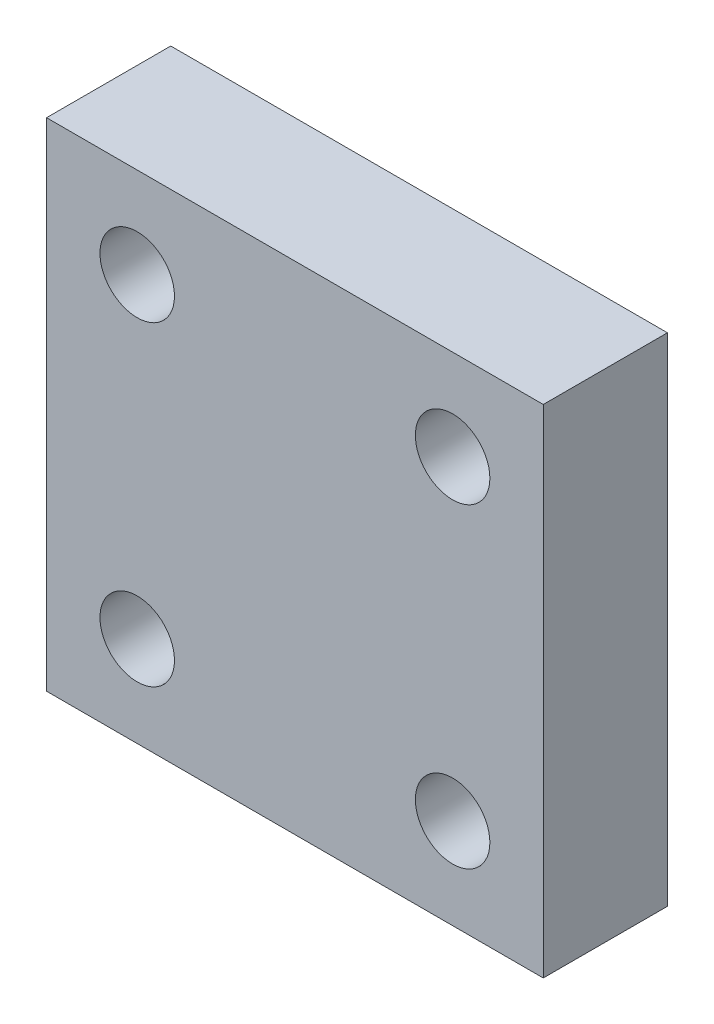
ISO-10303-21;
HEADER;
FILE_DESCRIPTION(('STEP AP214'),'2;1');
FILE_NAME('part.step','',(''),(''),'','','');
FILE_SCHEMA(('AUTOMOTIVE_DESIGN { 1 0 10303 214 1 1 1 1 }'));
ENDSEC;
DATA;
#1=APPLICATION_CONTEXT('core data for automotive mechanical design processes');
#2=APPLICATION_PROTOCOL_DEFINITION('international standard','automotive_design',2000,#1);
#3=PRODUCT_CONTEXT('',#1,'mechanical');
#4=PRODUCT('Part','Part','',(#3));
#5=PRODUCT_RELATED_PRODUCT_CATEGORY('part','',(#4));
#6=PRODUCT_DEFINITION_FORMATION('','',#4);
#7=PRODUCT_DEFINITION_CONTEXT('part definition',#1,'design');
#8=PRODUCT_DEFINITION('design','',#6,#7);
#9=PRODUCT_DEFINITION_SHAPE('','',#8);
#10=(LENGTH_UNIT() NAMED_UNIT(*) SI_UNIT(.MILLI.,.METRE.));
#11=(NAMED_UNIT(*) PLANE_ANGLE_UNIT() SI_UNIT($,.RADIAN.));
#12=(NAMED_UNIT(*) SI_UNIT($,.STERADIAN.) SOLID_ANGLE_UNIT());
#13=UNCERTAINTY_MEASURE_WITH_UNIT(LENGTH_MEASURE(1.E-05),#10,'distance_accuracy_value','');
#14=(GEOMETRIC_REPRESENTATION_CONTEXT(3) GLOBAL_UNCERTAINTY_ASSIGNED_CONTEXT((#13)) GLOBAL_UNIT_ASSIGNED_CONTEXT((#10,
#11,#12)) REPRESENTATION_CONTEXT('',''));
#15=CARTESIAN_POINT('',(0.,0.,0.));
#16=DIRECTION('',(0.,0.,1.));
#17=DIRECTION('',(1.,0.,0.));
#18=AXIS2_PLACEMENT_3D('',#15,#16,#17);
#19=CARTESIAN_POINT('',(0.,0.,0.));
#20=DIRECTION('',(0.,0.,-1.));
#21=DIRECTION('',(-1.,0.,0.));
#22=AXIS2_PLACEMENT_3D('',#19,#20,#21);
#23=PLANE('',#22);
#24=CARTESIAN_POINT('',(-4.12000000000012,-4.12500000000002,0.));
#25=DIRECTION('',(0.,0.,1.));
#26=DIRECTION('',(1.,0.,0.));
#27=AXIS2_PLACEMENT_3D('',#24,#25,#26);
#28=CIRCLE('',#27,1.32);
#29=CARTESIAN_POINT('',(-2.80000000000012,-4.12500000000002,0.));
#30=VERTEX_POINT('',#29);
#31=EDGE_CURVE('E124',#30,#30,#28,.T.);
#32=ORIENTED_EDGE('',*,*,#31,.T.);
#33=EDGE_LOOP('',(#32));
#34=FACE_BOUND('',#33,.T.);
#35=CARTESIAN_POINT('',(-35.87,-35.875,0.));
#36=DIRECTION('',(0.,0.,1.));
#37=DIRECTION('',(1.,0.,0.));
#38=AXIS2_PLACEMENT_3D('',#35,#36,#37);
#39=CIRCLE('',#38,1.32);
#40=CARTESIAN_POINT('',(-34.55,-35.875,0.));
#41=VERTEX_POINT('',#40);
#42=EDGE_CURVE('E112',#41,#41,#39,.T.);
#43=ORIENTED_EDGE('',*,*,#42,.T.);
#44=EDGE_LOOP('',(#43));
#45=FACE_BOUND('',#44,.T.);
#46=DIRECTION('',(0.,1.,0.));
#47=VECTOR('',#46,1.);
#48=CARTESIAN_POINT('',(0.,0.,0.));
#49=LINE('',#48,#47);
#50=CARTESIAN_POINT('',(0.,-40.,0.));
#51=VERTEX_POINT('',#50);
#52=CARTESIAN_POINT('',(0.,0.,0.));
#53=VERTEX_POINT('',#52);
#54=EDGE_CURVE('E98',#51,#53,#49,.T.);
#55=ORIENTED_EDGE('',*,*,#54,.F.);
#56=DIRECTION('',(1.,0.,0.));
#57=VECTOR('',#56,1.);
#58=CARTESIAN_POINT('',(0.,-40.,0.));
#59=LINE('',#58,#57);
#60=CARTESIAN_POINT('',(-40.,-40.,0.));
#61=VERTEX_POINT('',#60);
#62=EDGE_CURVE('E74',#61,#51,#59,.T.);
#63=ORIENTED_EDGE('',*,*,#62,.F.);
#64=DIRECTION('',(0.,-1.,0.));
#65=VECTOR('',#64,1.);
#66=CARTESIAN_POINT('',(-40.,0.,0.));
#67=LINE('',#66,#65);
#68=CARTESIAN_POINT('',(-40.,0.,0.));
#69=VERTEX_POINT('',#68);
#70=EDGE_CURVE('E68',#69,#61,#67,.T.);
#71=ORIENTED_EDGE('',*,*,#70,.F.);
#72=DIRECTION('',(-1.,0.,0.));
#73=VECTOR('',#72,1.);
#74=CARTESIAN_POINT('',(0.,0.,0.));
#75=LINE('',#74,#73);
#76=EDGE_CURVE('E90',#53,#69,#75,.T.);
#77=ORIENTED_EDGE('',*,*,#76,.F.);
#78=EDGE_LOOP('',(#55,#63,#71,#77));
#79=FACE_BOUND('',#78,.T.);
#80=CARTESIAN_POINT('',(-4.12000000000001,-35.875,0.));
#81=DIRECTION('',(0.,0.,1.));
#82=DIRECTION('',(1.,0.,0.));
#83=AXIS2_PLACEMENT_3D('',#80,#81,#82);
#84=CIRCLE('',#83,1.32);
#85=CARTESIAN_POINT('',(-2.8,-35.875,0.));
#86=VERTEX_POINT('',#85);
#87=EDGE_CURVE('E118',#86,#86,#84,.T.);
#88=ORIENTED_EDGE('',*,*,#87,.T.);
#89=EDGE_LOOP('',(#88));
#90=FACE_BOUND('',#89,.T.);
#91=CARTESIAN_POINT('',(-35.8700000000001,-4.12500000000002,0.));
#92=DIRECTION('',(0.,0.,1.));
#93=DIRECTION('',(1.,0.,0.));
#94=AXIS2_PLACEMENT_3D('',#91,#92,#93);
#95=CIRCLE('',#94,1.32);
#96=CARTESIAN_POINT('',(-34.5500000000001,-4.12500000000002,0.));
#97=VERTEX_POINT('',#96);
#98=EDGE_CURVE('E130',#97,#97,#95,.T.);
#99=ORIENTED_EDGE('',*,*,#98,.T.);
#100=EDGE_LOOP('',(#99));
#101=FACE_BOUND('',#100,.T.);
#102=ADVANCED_FACE('F34',(#34,#45,#79,#90,#101),#23,.T.);
#103=CARTESIAN_POINT('',(0.,0.,10.));
#104=DIRECTION('',(-1.,0.,0.));
#105=DIRECTION('',(0.,-1.,0.));
#106=AXIS2_PLACEMENT_3D('',#103,#104,#105);
#107=PLANE('',#106);
#108=ORIENTED_EDGE('',*,*,#54,.T.);
#109=DIRECTION('',(0.,0.,-1.));
#110=VECTOR('',#109,1.);
#111=CARTESIAN_POINT('',(0.,0.,10.));
#112=LINE('',#111,#110);
#113=CARTESIAN_POINT('',(0.,0.,10.));
#114=VERTEX_POINT('',#113);
#115=EDGE_CURVE('E11',#114,#53,#112,.T.);
#116=ORIENTED_EDGE('',*,*,#115,.F.);
#117=DIRECTION('',(0.,1.,0.));
#118=VECTOR('',#117,1.);
#119=CARTESIAN_POINT('',(0.,0.,10.));
#120=LINE('',#119,#118);
#121=CARTESIAN_POINT('',(0.,-40.,10.));
#122=VERTEX_POINT('',#121);
#123=EDGE_CURVE('E86',#122,#114,#120,.T.);
#124=ORIENTED_EDGE('',*,*,#123,.F.);
#125=DIRECTION('',(0.,0.,-1.));
#126=VECTOR('',#125,1.);
#127=CARTESIAN_POINT('',(0.,-40.,10.));
#128=LINE('',#127,#126);
#129=EDGE_CURVE('E94',#122,#51,#128,.T.);
#130=ORIENTED_EDGE('',*,*,#129,.T.);
#131=EDGE_LOOP('',(#108,#116,#124,#130));
#132=FACE_BOUND('',#131,.T.);
#133=ADVANCED_FACE('F36',(#132),#107,.F.);
#134=CARTESIAN_POINT('',(0.,0.,10.));
#135=DIRECTION('',(0.,-1.,0.));
#136=DIRECTION('',(1.,0.,0.));
#137=AXIS2_PLACEMENT_3D('',#134,#135,#136);
#138=PLANE('',#137);
#139=ORIENTED_EDGE('',*,*,#76,.T.);
#140=DIRECTION('',(0.,0.,-1.));
#141=VECTOR('',#140,1.);
#142=CARTESIAN_POINT('',(-40.,0.,10.));
#143=LINE('',#142,#141);
#144=CARTESIAN_POINT('',(-40.,0.,10.));
#145=VERTEX_POINT('',#144);
#146=EDGE_CURVE('E43',#145,#69,#143,.T.);
#147=ORIENTED_EDGE('',*,*,#146,.F.);
#148=DIRECTION('',(-1.,0.,0.));
#149=VECTOR('',#148,1.);
#150=CARTESIAN_POINT('',(0.,0.,10.));
#151=LINE('',#150,#149);
#152=EDGE_CURVE('E81',#114,#145,#151,.T.);
#153=ORIENTED_EDGE('',*,*,#152,.F.);
#154=ORIENTED_EDGE('',*,*,#115,.T.);
#155=EDGE_LOOP('',(#139,#147,#153,#154));
#156=FACE_BOUND('',#155,.T.);
#157=ADVANCED_FACE('F89',(#156),#138,.F.);
#158=CARTESIAN_POINT('',(-40.,0.,10.));
#159=DIRECTION('',(1.,0.,0.));
#160=DIRECTION('',(0.,1.,0.));
#161=AXIS2_PLACEMENT_3D('',#158,#159,#160);
#162=PLANE('',#161);
#163=ORIENTED_EDGE('',*,*,#70,.T.);
#164=DIRECTION('',(0.,0.,-1.));
#165=VECTOR('',#164,1.);
#166=CARTESIAN_POINT('',(-40.,-40.,10.));
#167=LINE('',#166,#165);
#168=CARTESIAN_POINT('',(-40.,-40.,10.));
#169=VERTEX_POINT('',#168);
#170=EDGE_CURVE('E91',#169,#61,#167,.T.);
#171=ORIENTED_EDGE('',*,*,#170,.F.);
#172=DIRECTION('',(0.,-1.,0.));
#173=VECTOR('',#172,1.);
#174=CARTESIAN_POINT('',(-40.,0.,10.));
#175=LINE('',#174,#173);
#176=EDGE_CURVE('E84',#145,#169,#175,.T.);
#177=ORIENTED_EDGE('',*,*,#176,.F.);
#178=ORIENTED_EDGE('',*,*,#146,.T.);
#179=EDGE_LOOP('',(#163,#171,#177,#178));
#180=FACE_BOUND('',#179,.T.);
#181=ADVANCED_FACE('F92',(#180),#162,.F.);
#182=CARTESIAN_POINT('',(0.,-40.,10.));
#183=DIRECTION('',(0.,1.,0.));
#184=DIRECTION('',(0.,0.,1.));
#185=AXIS2_PLACEMENT_3D('',#182,#183,#184);
#186=PLANE('',#185);
#187=ORIENTED_EDGE('',*,*,#62,.T.);
#188=ORIENTED_EDGE('',*,*,#129,.F.);
#189=DIRECTION('',(1.,0.,0.));
#190=VECTOR('',#189,1.);
#191=CARTESIAN_POINT('',(0.,-40.,10.));
#192=LINE('',#191,#190);
#193=EDGE_CURVE('E51',#169,#122,#192,.T.);
#194=ORIENTED_EDGE('',*,*,#193,.F.);
#195=ORIENTED_EDGE('',*,*,#170,.T.);
#196=EDGE_LOOP('',(#187,#188,#194,#195));
#197=FACE_BOUND('',#196,.T.);
#198=ADVANCED_FACE('F106',(#197),#186,.F.);
#199=CARTESIAN_POINT('',(0.,0.,10.));
#200=DIRECTION('',(0.,0.,-1.));
#201=DIRECTION('',(-1.,0.,0.));
#202=AXIS2_PLACEMENT_3D('',#199,#200,#201);
#203=PLANE('',#202);
#204=CARTESIAN_POINT('',(-32.6999999999997,-32.7,10.));
#205=DIRECTION('',(0.,0.,1.));
#206=DIRECTION('',(1.,0.,0.));
#207=AXIS2_PLACEMENT_3D('',#204,#205,#206);
#208=CIRCLE('',#207,3.);
#209=CARTESIAN_POINT('',(-29.6999999999997,-32.7,10.));
#210=VERTEX_POINT('',#209);
#211=EDGE_CURVE('E154',#210,#210,#208,.T.);
#212=ORIENTED_EDGE('',*,*,#211,.F.);
#213=EDGE_LOOP('',(#212));
#214=FACE_BOUND('',#213,.T.);
#215=CARTESIAN_POINT('',(-7.29999999999974,-32.6999999999996,10.));
#216=DIRECTION('',(0.,0.,1.));
#217=DIRECTION('',(1.,0.,0.));
#218=AXIS2_PLACEMENT_3D('',#215,#216,#217);
#219=CIRCLE('',#218,3.);
#220=CARTESIAN_POINT('',(-4.29999999999974,-32.6999999999996,10.));
#221=VERTEX_POINT('',#220);
#222=EDGE_CURVE('E148',#221,#221,#219,.T.);
#223=ORIENTED_EDGE('',*,*,#222,.F.);
#224=EDGE_LOOP('',(#223));
#225=FACE_BOUND('',#224,.T.);
#226=CARTESIAN_POINT('',(-7.30000000000001,-7.29999999999965,10.));
#227=DIRECTION('',(0.,0.,1.));
#228=DIRECTION('',(1.,0.,0.));
#229=AXIS2_PLACEMENT_3D('',#226,#227,#228);
#230=CIRCLE('',#229,3.);
#231=CARTESIAN_POINT('',(-4.30000000000001,-7.29999999999965,10.));
#232=VERTEX_POINT('',#231);
#233=EDGE_CURVE('E142',#232,#232,#230,.T.);
#234=ORIENTED_EDGE('',*,*,#233,.F.);
#235=EDGE_LOOP('',(#234));
#236=FACE_BOUND('',#235,.T.);
#237=CARTESIAN_POINT('',(-32.7,-7.3,10.));
#238=DIRECTION('',(0.,0.,1.));
#239=DIRECTION('',(1.,0.,0.));
#240=AXIS2_PLACEMENT_3D('',#237,#238,#239);
#241=CIRCLE('',#240,3.);
#242=CARTESIAN_POINT('',(-29.7,-7.3,10.));
#243=VERTEX_POINT('',#242);
#244=EDGE_CURVE('E136',#243,#243,#241,.T.);
#245=ORIENTED_EDGE('',*,*,#244,.F.);
#246=EDGE_LOOP('',(#245));
#247=FACE_BOUND('',#246,.T.);
#248=ORIENTED_EDGE('',*,*,#123,.T.);
#249=ORIENTED_EDGE('',*,*,#152,.T.);
#250=ORIENTED_EDGE('',*,*,#176,.T.);
#251=ORIENTED_EDGE('',*,*,#193,.T.);
#252=EDGE_LOOP('',(#248,#249,#250,#251));
#253=FACE_BOUND('',#252,.T.);
#254=ADVANCED_FACE('F82',(#214,#225,#236,#247,#253),#203,.F.);
#255=CARTESIAN_POINT('',(-35.87,-35.875,5.));
#256=DIRECTION('',(0.,0.,-1.));
#257=DIRECTION('',(-1.,0.,0.));
#258=AXIS2_PLACEMENT_3D('',#255,#256,#257);
#259=CYLINDRICAL_SURFACE('',#258,1.32);
#260=CARTESIAN_POINT('',(-35.87,-35.875,5.));
#261=DIRECTION('',(0.,0.,1.));
#262=DIRECTION('',(1.,0.,0.));
#263=AXIS2_PLACEMENT_3D('',#260,#261,#262);
#264=CIRCLE('',#263,1.32);
#265=CARTESIAN_POINT('',(-34.55,-35.875,5.));
#266=VERTEX_POINT('',#265);
#267=EDGE_CURVE('E101',#266,#266,#264,.T.);
#268=ORIENTED_EDGE('',*,*,#267,.T.);
#269=EDGE_LOOP('',(#268));
#270=FACE_BOUND('',#269,.T.);
#271=ORIENTED_EDGE('',*,*,#42,.F.);
#272=EDGE_LOOP('',(#271));
#273=FACE_BOUND('',#272,.T.);
#274=ADVANCED_FACE('F171',(#270,#273),#259,.F.);
#275=CARTESIAN_POINT('',(-35.87,-35.875,5.));
#276=DIRECTION('',(0.,0.,1.));
#277=DIRECTION('',(1.,0.,0.));
#278=AXIS2_PLACEMENT_3D('',#275,#276,#277);
#279=PLANE('',#278);
#280=ORIENTED_EDGE('',*,*,#267,.F.);
#281=EDGE_LOOP('',(#280));
#282=FACE_BOUND('',#281,.T.);
#283=ADVANCED_FACE('F231',(#282),#279,.F.);
#284=CARTESIAN_POINT('',(-4.12000000000001,-35.875,5.));
#285=DIRECTION('',(0.,0.,-1.));
#286=DIRECTION('',(-1.,0.,0.));
#287=AXIS2_PLACEMENT_3D('',#284,#285,#286);
#288=CYLINDRICAL_SURFACE('',#287,1.32);
#289=CARTESIAN_POINT('',(-4.12000000000001,-35.875,5.));
#290=DIRECTION('',(0.,0.,1.));
#291=DIRECTION('',(1.,0.,0.));
#292=AXIS2_PLACEMENT_3D('',#289,#290,#291);
#293=CIRCLE('',#292,1.32);
#294=CARTESIAN_POINT('',(-2.8,-35.875,5.));
#295=VERTEX_POINT('',#294);
#296=EDGE_CURVE('E115',#295,#295,#293,.T.);
#297=ORIENTED_EDGE('',*,*,#296,.T.);
#298=EDGE_LOOP('',(#297));
#299=FACE_BOUND('',#298,.T.);
#300=ORIENTED_EDGE('',*,*,#87,.F.);
#301=EDGE_LOOP('',(#300));
#302=FACE_BOUND('',#301,.T.);
#303=ADVANCED_FACE('F238',(#299,#302),#288,.F.);
#304=CARTESIAN_POINT('',(-4.12000000000001,-35.875,5.));
#305=DIRECTION('',(0.,0.,1.));
#306=DIRECTION('',(1.,0.,0.));
#307=AXIS2_PLACEMENT_3D('',#304,#305,#306);
#308=PLANE('',#307);
#309=ORIENTED_EDGE('',*,*,#296,.F.);
#310=EDGE_LOOP('',(#309));
#311=FACE_BOUND('',#310,.T.);
#312=ADVANCED_FACE('F246',(#311),#308,.F.);
#313=CARTESIAN_POINT('',(-4.12000000000012,-4.12500000000002,5.));
#314=DIRECTION('',(0.,0.,-1.));
#315=DIRECTION('',(-1.,0.,0.));
#316=AXIS2_PLACEMENT_3D('',#313,#314,#315);
#317=CYLINDRICAL_SURFACE('',#316,1.32);
#318=CARTESIAN_POINT('',(-4.12000000000012,-4.12500000000002,5.));
#319=DIRECTION('',(0.,0.,1.));
#320=DIRECTION('',(1.,0.,0.));
#321=AXIS2_PLACEMENT_3D('',#318,#319,#320);
#322=CIRCLE('',#321,1.32);
#323=CARTESIAN_POINT('',(-2.80000000000012,-4.12500000000002,5.));
#324=VERTEX_POINT('',#323);
#325=EDGE_CURVE('E121',#324,#324,#322,.T.);
#326=ORIENTED_EDGE('',*,*,#325,.T.);
#327=EDGE_LOOP('',(#326));
#328=FACE_BOUND('',#327,.T.);
#329=ORIENTED_EDGE('',*,*,#31,.F.);
#330=EDGE_LOOP('',(#329));
#331=FACE_BOUND('',#330,.T.);
#332=ADVANCED_FACE('F254',(#328,#331),#317,.F.);
#333=CARTESIAN_POINT('',(-4.12000000000012,-4.12500000000002,5.));
#334=DIRECTION('',(0.,0.,1.));
#335=DIRECTION('',(1.,0.,0.));
#336=AXIS2_PLACEMENT_3D('',#333,#334,#335);
#337=PLANE('',#336);
#338=ORIENTED_EDGE('',*,*,#325,.F.);
#339=EDGE_LOOP('',(#338));
#340=FACE_BOUND('',#339,.T.);
#341=ADVANCED_FACE('F262',(#340),#337,.F.);
#342=CARTESIAN_POINT('',(-35.8700000000001,-4.12500000000002,5.));
#343=DIRECTION('',(0.,0.,-1.));
#344=DIRECTION('',(-1.,0.,0.));
#345=AXIS2_PLACEMENT_3D('',#342,#343,#344);
#346=CYLINDRICAL_SURFACE('',#345,1.32);
#347=CARTESIAN_POINT('',(-35.8700000000001,-4.12500000000002,5.));
#348=DIRECTION('',(0.,0.,1.));
#349=DIRECTION('',(1.,0.,0.));
#350=AXIS2_PLACEMENT_3D('',#347,#348,#349);
#351=CIRCLE('',#350,1.32);
#352=CARTESIAN_POINT('',(-34.5500000000001,-4.12500000000002,5.));
#353=VERTEX_POINT('',#352);
#354=EDGE_CURVE('E127',#353,#353,#351,.T.);
#355=ORIENTED_EDGE('',*,*,#354,.T.);
#356=EDGE_LOOP('',(#355));
#357=FACE_BOUND('',#356,.T.);
#358=ORIENTED_EDGE('',*,*,#98,.F.);
#359=EDGE_LOOP('',(#358));
#360=FACE_BOUND('',#359,.T.);
#361=ADVANCED_FACE('F192',(#357,#360),#346,.F.);
#362=CARTESIAN_POINT('',(-35.8700000000001,-4.12500000000002,5.));
#363=DIRECTION('',(0.,0.,1.));
#364=DIRECTION('',(1.,0.,0.));
#365=AXIS2_PLACEMENT_3D('',#362,#363,#364);
#366=PLANE('',#365);
#367=ORIENTED_EDGE('',*,*,#354,.F.);
#368=EDGE_LOOP('',(#367));
#369=FACE_BOUND('',#368,.T.);
#370=ADVANCED_FACE('F182',(#369),#366,.F.);
#371=CARTESIAN_POINT('',(-32.7,-7.3,5.));
#372=DIRECTION('',(0.,0.,1.));
#373=DIRECTION('',(1.,0.,0.));
#374=AXIS2_PLACEMENT_3D('',#371,#372,#373);
#375=CYLINDRICAL_SURFACE('',#374,3.);
#376=CARTESIAN_POINT('',(-32.7,-7.3,5.));
#377=DIRECTION('',(0.,0.,1.));
#378=DIRECTION('',(1.,0.,0.));
#379=AXIS2_PLACEMENT_3D('',#376,#377,#378);
#380=CIRCLE('',#379,3.);
#381=CARTESIAN_POINT('',(-29.7,-7.3,5.));
#382=VERTEX_POINT('',#381);
#383=EDGE_CURVE('E133',#382,#382,#380,.T.);
#384=ORIENTED_EDGE('',*,*,#383,.F.);
#385=EDGE_LOOP('',(#384));
#386=FACE_BOUND('',#385,.T.);
#387=ORIENTED_EDGE('',*,*,#244,.T.);
#388=EDGE_LOOP('',(#387));
#389=FACE_BOUND('',#388,.T.);
#390=ADVANCED_FACE('F179',(#386,#389),#375,.F.);
#391=CARTESIAN_POINT('',(-32.7,-7.3,5.));
#392=DIRECTION('',(0.,0.,1.));
#393=DIRECTION('',(1.,0.,0.));
#394=AXIS2_PLACEMENT_3D('',#391,#392,#393);
#395=PLANE('',#394);
#396=ORIENTED_EDGE('',*,*,#383,.T.);
#397=EDGE_LOOP('',(#396));
#398=FACE_BOUND('',#397,.T.);
#399=ADVANCED_FACE('F181',(#398),#395,.T.);
#400=CARTESIAN_POINT('',(-7.30000000000001,-7.29999999999965,5.));
#401=DIRECTION('',(0.,0.,1.));
#402=DIRECTION('',(1.,0.,0.));
#403=AXIS2_PLACEMENT_3D('',#400,#401,#402);
#404=CYLINDRICAL_SURFACE('',#403,3.);
#405=CARTESIAN_POINT('',(-7.30000000000001,-7.29999999999965,5.));
#406=DIRECTION('',(0.,0.,1.));
#407=DIRECTION('',(1.,0.,0.));
#408=AXIS2_PLACEMENT_3D('',#405,#406,#407);
#409=CIRCLE('',#408,3.);
#410=CARTESIAN_POINT('',(-4.30000000000001,-7.29999999999965,5.));
#411=VERTEX_POINT('',#410);
#412=EDGE_CURVE('E139',#411,#411,#409,.T.);
#413=ORIENTED_EDGE('',*,*,#412,.F.);
#414=EDGE_LOOP('',(#413));
#415=FACE_BOUND('',#414,.T.);
#416=ORIENTED_EDGE('',*,*,#233,.T.);
#417=EDGE_LOOP('',(#416));
#418=FACE_BOUND('',#417,.T.);
#419=ADVANCED_FACE('F189',(#415,#418),#404,.F.);
#420=CARTESIAN_POINT('',(-7.30000000000001,-7.29999999999965,5.));
#421=DIRECTION('',(0.,0.,1.));
#422=DIRECTION('',(1.,0.,0.));
#423=AXIS2_PLACEMENT_3D('',#420,#421,#422);
#424=PLANE('',#423);
#425=ORIENTED_EDGE('',*,*,#412,.T.);
#426=EDGE_LOOP('',(#425));
#427=FACE_BOUND('',#426,.T.);
#428=ADVANCED_FACE('F306',(#427),#424,.T.);
#429=CARTESIAN_POINT('',(-7.29999999999974,-32.6999999999996,5.));
#430=DIRECTION('',(0.,0.,1.));
#431=DIRECTION('',(1.,0.,0.));
#432=AXIS2_PLACEMENT_3D('',#429,#430,#431);
#433=CYLINDRICAL_SURFACE('',#432,3.);
#434=CARTESIAN_POINT('',(-7.29999999999974,-32.6999999999996,5.));
#435=DIRECTION('',(0.,0.,1.));
#436=DIRECTION('',(1.,0.,0.));
#437=AXIS2_PLACEMENT_3D('',#434,#435,#436);
#438=CIRCLE('',#437,3.);
#439=CARTESIAN_POINT('',(-4.29999999999974,-32.6999999999996,5.));
#440=VERTEX_POINT('',#439);
#441=EDGE_CURVE('E145',#440,#440,#438,.T.);
#442=ORIENTED_EDGE('',*,*,#441,.F.);
#443=EDGE_LOOP('',(#442));
#444=FACE_BOUND('',#443,.T.);
#445=ORIENTED_EDGE('',*,*,#222,.T.);
#446=EDGE_LOOP('',(#445));
#447=FACE_BOUND('',#446,.T.);
#448=ADVANCED_FACE('F316',(#444,#447),#433,.F.);
#449=CARTESIAN_POINT('',(-7.29999999999974,-32.6999999999996,5.));
#450=DIRECTION('',(0.,0.,1.));
#451=DIRECTION('',(1.,0.,0.));
#452=AXIS2_PLACEMENT_3D('',#449,#450,#451);
#453=PLANE('',#452);
#454=ORIENTED_EDGE('',*,*,#441,.T.);
#455=EDGE_LOOP('',(#454));
#456=FACE_BOUND('',#455,.T.);
#457=ADVANCED_FACE('F165',(#456),#453,.T.);
#458=CARTESIAN_POINT('',(-32.6999999999997,-32.7,5.));
#459=DIRECTION('',(0.,0.,1.));
#460=DIRECTION('',(1.,0.,0.));
#461=AXIS2_PLACEMENT_3D('',#458,#459,#460);
#462=CYLINDRICAL_SURFACE('',#461,3.);
#463=CARTESIAN_POINT('',(-32.6999999999997,-32.7,5.));
#464=DIRECTION('',(0.,0.,1.));
#465=DIRECTION('',(1.,0.,0.));
#466=AXIS2_PLACEMENT_3D('',#463,#464,#465);
#467=CIRCLE('',#466,3.);
#468=CARTESIAN_POINT('',(-29.6999999999997,-32.7,5.));
#469=VERTEX_POINT('',#468);
#470=EDGE_CURVE('E151',#469,#469,#467,.T.);
#471=ORIENTED_EDGE('',*,*,#470,.F.);
#472=EDGE_LOOP('',(#471));
#473=FACE_BOUND('',#472,.T.);
#474=ORIENTED_EDGE('',*,*,#211,.T.);
#475=EDGE_LOOP('',(#474));
#476=FACE_BOUND('',#475,.T.);
#477=ADVANCED_FACE('F162',(#473,#476),#462,.F.);
#478=CARTESIAN_POINT('',(-32.6999999999997,-32.7,5.));
#479=DIRECTION('',(0.,0.,1.));
#480=DIRECTION('',(1.,0.,0.));
#481=AXIS2_PLACEMENT_3D('',#478,#479,#480);
#482=PLANE('',#481);
#483=ORIENTED_EDGE('',*,*,#470,.T.);
#484=EDGE_LOOP('',(#483));
#485=FACE_BOUND('',#484,.T.);
#486=ADVANCED_FACE('F160',(#485),#482,.T.);
#487=CLOSED_SHELL('',(#102,#133,#157,#181,#198,#254,#274,#283,#303,#312,#332,#341,#361,#370,
#390,#399,#419,#428,#448,#457,#477,#486));
#488=MANIFOLD_SOLID_BREP('B2',#487);
#489=ADVANCED_BREP_SHAPE_REPRESENTATION('',(#18,#488),#14);
#490=SHAPE_DEFINITION_REPRESENTATION(#9,#489);
ENDSEC;
END-ISO-10303-21;
